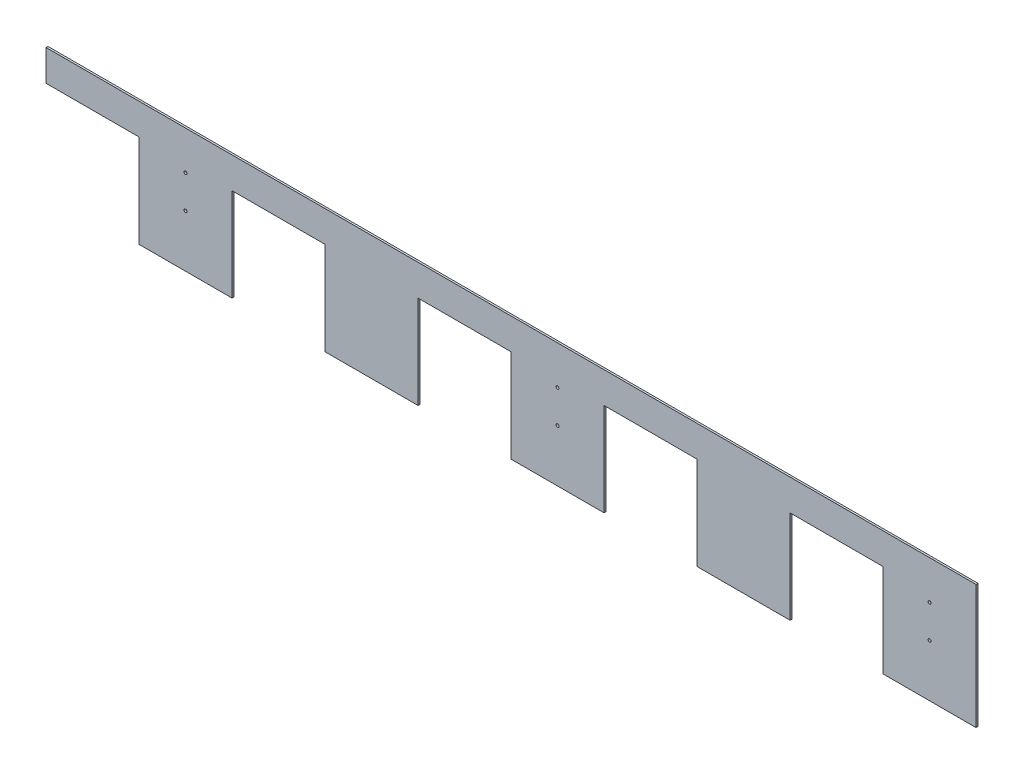
ISO-10303-21;
HEADER;
FILE_DESCRIPTION(('STEP AP214'),'2;1');
FILE_NAME('part.step','',(''),(''),'','','');
FILE_SCHEMA(('AUTOMOTIVE_DESIGN { 1 0 10303 214 1 1 1 1 }'));
ENDSEC;
DATA;
#1=APPLICATION_CONTEXT('core data for automotive mechanical design processes');
#2=APPLICATION_PROTOCOL_DEFINITION('international standard','automotive_design',2000,#1);
#3=PRODUCT_CONTEXT('',#1,'mechanical');
#4=PRODUCT('Part','Part','',(#3));
#5=PRODUCT_RELATED_PRODUCT_CATEGORY('part','',(#4));
#6=PRODUCT_DEFINITION_FORMATION('','',#4);
#7=PRODUCT_DEFINITION_CONTEXT('part definition',#1,'design');
#8=PRODUCT_DEFINITION('design','',#6,#7);
#9=PRODUCT_DEFINITION_SHAPE('','',#8);
#10=(LENGTH_UNIT() NAMED_UNIT(*) SI_UNIT(.MILLI.,.METRE.));
#11=(NAMED_UNIT(*) PLANE_ANGLE_UNIT() SI_UNIT($,.RADIAN.));
#12=(NAMED_UNIT(*) SI_UNIT($,.STERADIAN.) SOLID_ANGLE_UNIT());
#13=UNCERTAINTY_MEASURE_WITH_UNIT(LENGTH_MEASURE(1.E-05),#10,'distance_accuracy_value','');
#14=(GEOMETRIC_REPRESENTATION_CONTEXT(3) GLOBAL_UNCERTAINTY_ASSIGNED_CONTEXT((#13)) GLOBAL_UNIT_ASSIGNED_CONTEXT((#10,
#11,#12)) REPRESENTATION_CONTEXT('',''));
#15=CARTESIAN_POINT('',(0.,0.,0.));
#16=DIRECTION('',(0.,0.,1.));
#17=DIRECTION('',(1.,0.,0.));
#18=AXIS2_PLACEMENT_3D('',#15,#16,#17);
#19=CARTESIAN_POINT('',(0.,0.,3.175));
#20=DIRECTION('',(0.,0.,1.));
#21=DIRECTION('',(1.,0.,0.));
#22=AXIS2_PLACEMENT_3D('',#19,#20,#21);
#23=PLANE('',#22);
#24=CARTESIAN_POINT('',(-533.4,38.1,3.175));
#25=DIRECTION('',(0.,0.,-1.));
#26=DIRECTION('',(-1.,0.,0.));
#27=AXIS2_PLACEMENT_3D('',#24,#25,#26);
#28=CIRCLE('',#27,2.4384);
#29=CARTESIAN_POINT('',(-535.8384,38.1,3.175));
#30=VERTEX_POINT('',#29);
#31=EDGE_CURVE('E205',#30,#30,#28,.T.);
#32=ORIENTED_EDGE('',*,*,#31,.T.);
#33=EDGE_LOOP('',(#32));
#34=FACE_BOUND('',#33,.T.);
#35=CARTESIAN_POINT('',(-533.4,-15.875,3.175));
#36=DIRECTION('',(0.,0.,-1.));
#37=DIRECTION('',(-1.,0.,0.));
#38=AXIS2_PLACEMENT_3D('',#35,#36,#37);
#39=CIRCLE('',#38,2.4384);
#40=CARTESIAN_POINT('',(-535.8384,-15.875,3.175));
#41=VERTEX_POINT('',#40);
#42=EDGE_CURVE('E208',#41,#41,#39,.T.);
#43=ORIENTED_EDGE('',*,*,#42,.T.);
#44=EDGE_LOOP('',(#43));
#45=FACE_BOUND('',#44,.T.);
#46=CARTESIAN_POINT('',(76.2,38.1,3.175));
#47=DIRECTION('',(0.,0.,-1.));
#48=DIRECTION('',(-1.,0.,0.));
#49=AXIS2_PLACEMENT_3D('',#46,#47,#48);
#50=CIRCLE('',#49,2.4384);
#51=CARTESIAN_POINT('',(73.7616,38.1,3.175));
#52=VERTEX_POINT('',#51);
#53=EDGE_CURVE('E211',#52,#52,#50,.T.);
#54=ORIENTED_EDGE('',*,*,#53,.T.);
#55=EDGE_LOOP('',(#54));
#56=FACE_BOUND('',#55,.T.);
#57=CARTESIAN_POINT('',(76.2,-15.875,3.175));
#58=DIRECTION('',(0.,0.,-1.));
#59=DIRECTION('',(-1.,0.,0.));
#60=AXIS2_PLACEMENT_3D('',#57,#58,#59);
#61=CIRCLE('',#60,2.4384);
#62=CARTESIAN_POINT('',(73.7616,-15.875,3.175));
#63=VERTEX_POINT('',#62);
#64=EDGE_CURVE('E214',#63,#63,#61,.T.);
#65=ORIENTED_EDGE('',*,*,#64,.T.);
#66=EDGE_LOOP('',(#65));
#67=FACE_BOUND('',#66,.T.);
#68=CARTESIAN_POINT('',(685.8,-15.875,3.175));
#69=DIRECTION('',(0.,0.,-1.));
#70=DIRECTION('',(-1.,0.,0.));
#71=AXIS2_PLACEMENT_3D('',#68,#69,#70);
#72=CIRCLE('',#71,2.4384);
#73=CARTESIAN_POINT('',(683.3616,-15.875,3.175));
#74=VERTEX_POINT('',#73);
#75=EDGE_CURVE('E216',#74,#74,#72,.T.);
#76=ORIENTED_EDGE('',*,*,#75,.T.);
#77=EDGE_LOOP('',(#76));
#78=FACE_BOUND('',#77,.T.);
#79=CARTESIAN_POINT('',(685.8,38.1,3.175));
#80=DIRECTION('',(0.,0.,-1.));
#81=DIRECTION('',(-1.,0.,0.));
#82=AXIS2_PLACEMENT_3D('',#79,#80,#81);
#83=CIRCLE('',#82,2.4384);
#84=CARTESIAN_POINT('',(683.3616,38.1,3.175));
#85=VERTEX_POINT('',#84);
#86=EDGE_CURVE('E20',#85,#85,#83,.T.);
#87=ORIENTED_EDGE('',*,*,#86,.T.);
#88=EDGE_LOOP('',(#87));
#89=FACE_BOUND('',#88,.T.);
#90=DIRECTION('',(1.,0.,0.));
#91=VECTOR('',#90,1.);
#92=CARTESIAN_POINT('',(-609.6,50.8,3.175));
#93=LINE('',#92,#91);
#94=CARTESIAN_POINT('',(-762.,50.8,3.175));
#95=VERTEX_POINT('',#94);
#96=CARTESIAN_POINT('',(-609.6,50.8,3.175));
#97=VERTEX_POINT('',#96);
#98=EDGE_CURVE('E177',#95,#97,#93,.T.);
#99=ORIENTED_EDGE('',*,*,#98,.T.);
#100=DIRECTION('',(0.,1.,0.));
#101=VECTOR('',#100,1.);
#102=CARTESIAN_POINT('',(-609.6,-101.6,3.175));
#103=LINE('',#102,#101);
#104=CARTESIAN_POINT('',(-609.6,-101.6,3.175));
#105=VERTEX_POINT('',#104);
#106=EDGE_CURVE('E174',#97,#105,#103,.F.);
#107=ORIENTED_EDGE('',*,*,#106,.T.);
#108=DIRECTION('',(1.,0.,0.));
#109=VECTOR('',#108,1.);
#110=CARTESIAN_POINT('',(-762.,-101.6,3.175));
#111=LINE('',#110,#109);
#112=CARTESIAN_POINT('',(-457.2,-101.6,3.175));
#113=VERTEX_POINT('',#112);
#114=EDGE_CURVE('E164',#113,#105,#111,.F.);
#115=ORIENTED_EDGE('',*,*,#114,.F.);
#116=DIRECTION('',(0.,1.,0.));
#117=VECTOR('',#116,1.);
#118=CARTESIAN_POINT('',(-457.2,50.8,3.175));
#119=LINE('',#118,#117);
#120=CARTESIAN_POINT('',(-457.2,50.8,3.175));
#121=VERTEX_POINT('',#120);
#122=EDGE_CURVE('E186',#113,#121,#119,.T.);
#123=ORIENTED_EDGE('',*,*,#122,.T.);
#124=DIRECTION('',(1.,0.,0.));
#125=VECTOR('',#124,1.);
#126=CARTESIAN_POINT('',(-304.8,50.8,3.175));
#127=LINE('',#126,#125);
#128=CARTESIAN_POINT('',(-304.8,50.8,3.175));
#129=VERTEX_POINT('',#128);
#130=EDGE_CURVE('E312',#121,#129,#127,.T.);
#131=ORIENTED_EDGE('',*,*,#130,.T.);
#132=DIRECTION('',(0.,1.,0.));
#133=VECTOR('',#132,1.);
#134=CARTESIAN_POINT('',(-304.8,-101.6,3.175));
#135=LINE('',#134,#133);
#136=CARTESIAN_POINT('',(-304.8,-101.6,3.175));
#137=VERTEX_POINT('',#136);
#138=EDGE_CURVE('E306',#129,#137,#135,.F.);
#139=ORIENTED_EDGE('',*,*,#138,.T.);
#140=DIRECTION('',(1.,0.,0.));
#141=VECTOR('',#140,1.);
#142=CARTESIAN_POINT('',(-762.,-101.6,3.175));
#143=LINE('',#142,#141);
#144=CARTESIAN_POINT('',(-152.4,-101.6,3.175));
#145=VERTEX_POINT('',#144);
#146=EDGE_CURVE('E304',#145,#137,#143,.F.);
#147=ORIENTED_EDGE('',*,*,#146,.F.);
#148=DIRECTION('',(0.,1.,0.));
#149=VECTOR('',#148,1.);
#150=CARTESIAN_POINT('',(-152.4,50.8,3.175));
#151=LINE('',#150,#149);
#152=CARTESIAN_POINT('',(-152.4,50.8,3.175));
#153=VERTEX_POINT('',#152);
#154=EDGE_CURVE('E297',#145,#153,#151,.T.);
#155=ORIENTED_EDGE('',*,*,#154,.T.);
#156=DIRECTION('',(1.,0.,0.));
#157=VECTOR('',#156,1.);
#158=CARTESIAN_POINT('',(0.,50.8,3.175));
#159=LINE('',#158,#157);
#160=CARTESIAN_POINT('',(0.,50.8,3.175));
#161=VERTEX_POINT('',#160);
#162=EDGE_CURVE('E292',#153,#161,#159,.T.);
#163=ORIENTED_EDGE('',*,*,#162,.T.);
#164=DIRECTION('',(0.,1.,0.));
#165=VECTOR('',#164,1.);
#166=CARTESIAN_POINT('',(0.,-101.6,3.175));
#167=LINE('',#166,#165);
#168=CARTESIAN_POINT('',(0.,-101.6,3.175));
#169=VERTEX_POINT('',#168);
#170=EDGE_CURVE('E286',#161,#169,#167,.F.);
#171=ORIENTED_EDGE('',*,*,#170,.T.);
#172=DIRECTION('',(1.,0.,0.));
#173=VECTOR('',#172,1.);
#174=CARTESIAN_POINT('',(-762.,-101.6,3.175));
#175=LINE('',#174,#173);
#176=CARTESIAN_POINT('',(152.4,-101.6,3.175));
#177=VERTEX_POINT('',#176);
#178=EDGE_CURVE('E284',#177,#169,#175,.F.);
#179=ORIENTED_EDGE('',*,*,#178,.F.);
#180=DIRECTION('',(0.,1.,0.));
#181=VECTOR('',#180,1.);
#182=CARTESIAN_POINT('',(152.4,50.8,3.175));
#183=LINE('',#182,#181);
#184=CARTESIAN_POINT('',(152.4,50.8,3.175));
#185=VERTEX_POINT('',#184);
#186=EDGE_CURVE('E277',#177,#185,#183,.T.);
#187=ORIENTED_EDGE('',*,*,#186,.T.);
#188=DIRECTION('',(1.,0.,0.));
#189=VECTOR('',#188,1.);
#190=CARTESIAN_POINT('',(304.8,50.8,3.175));
#191=LINE('',#190,#189);
#192=CARTESIAN_POINT('',(304.8,50.8,3.175));
#193=VERTEX_POINT('',#192);
#194=EDGE_CURVE('E272',#185,#193,#191,.T.);
#195=ORIENTED_EDGE('',*,*,#194,.T.);
#196=DIRECTION('',(0.,1.,0.));
#197=VECTOR('',#196,1.);
#198=CARTESIAN_POINT('',(304.8,-101.6,3.175));
#199=LINE('',#198,#197);
#200=CARTESIAN_POINT('',(304.8,-101.6,3.175));
#201=VERTEX_POINT('',#200);
#202=EDGE_CURVE('E266',#193,#201,#199,.F.);
#203=ORIENTED_EDGE('',*,*,#202,.T.);
#204=DIRECTION('',(1.,0.,0.));
#205=VECTOR('',#204,1.);
#206=CARTESIAN_POINT('',(-762.,-101.6,3.175));
#207=LINE('',#206,#205);
#208=CARTESIAN_POINT('',(457.2,-101.6,3.175));
#209=VERTEX_POINT('',#208);
#210=EDGE_CURVE('E264',#209,#201,#207,.F.);
#211=ORIENTED_EDGE('',*,*,#210,.F.);
#212=DIRECTION('',(0.,1.,0.));
#213=VECTOR('',#212,1.);
#214=CARTESIAN_POINT('',(457.2,50.8,3.175));
#215=LINE('',#214,#213);
#216=CARTESIAN_POINT('',(457.2,50.8,3.175));
#217=VERTEX_POINT('',#216);
#218=EDGE_CURVE('E257',#209,#217,#215,.T.);
#219=ORIENTED_EDGE('',*,*,#218,.T.);
#220=DIRECTION('',(1.,0.,0.));
#221=VECTOR('',#220,1.);
#222=CARTESIAN_POINT('',(609.6,50.8,3.175));
#223=LINE('',#222,#221);
#224=CARTESIAN_POINT('',(609.6,50.8,3.175));
#225=VERTEX_POINT('',#224);
#226=EDGE_CURVE('E252',#217,#225,#223,.T.);
#227=ORIENTED_EDGE('',*,*,#226,.T.);
#228=DIRECTION('',(0.,1.,0.));
#229=VECTOR('',#228,1.);
#230=CARTESIAN_POINT('',(609.6,-101.6,3.175));
#231=LINE('',#230,#229);
#232=CARTESIAN_POINT('',(609.6,-101.6,3.175));
#233=VERTEX_POINT('',#232);
#234=EDGE_CURVE('E246',#225,#233,#231,.F.);
#235=ORIENTED_EDGE('',*,*,#234,.T.);
#236=DIRECTION('',(1.,0.,0.));
#237=VECTOR('',#236,1.);
#238=CARTESIAN_POINT('',(-762.,-101.6,3.175));
#239=LINE('',#238,#237);
#240=CARTESIAN_POINT('',(762.,-101.6,3.175));
#241=VERTEX_POINT('',#240);
#242=EDGE_CURVE('E244',#241,#233,#239,.F.);
#243=ORIENTED_EDGE('',*,*,#242,.F.);
#244=DIRECTION('',(0.,1.,0.));
#245=VECTOR('',#244,1.);
#246=CARTESIAN_POINT('',(762.,-101.6,3.175));
#247=LINE('',#246,#245);
#248=CARTESIAN_POINT('',(762.,101.6,3.175));
#249=VERTEX_POINT('',#248);
#250=EDGE_CURVE('E240',#249,#241,#247,.F.);
#251=ORIENTED_EDGE('',*,*,#250,.F.);
#252=DIRECTION('',(1.,0.,0.));
#253=VECTOR('',#252,1.);
#254=CARTESIAN_POINT('',(762.,101.6,3.175));
#255=LINE('',#254,#253);
#256=CARTESIAN_POINT('',(-762.,101.6,3.175));
#257=VERTEX_POINT('',#256);
#258=EDGE_CURVE('E236',#257,#249,#255,.T.);
#259=ORIENTED_EDGE('',*,*,#258,.F.);
#260=DIRECTION('',(0.,1.,0.));
#261=VECTOR('',#260,1.);
#262=CARTESIAN_POINT('',(-762.,101.6,3.175));
#263=LINE('',#262,#261);
#264=EDGE_CURVE('E232',#95,#257,#263,.T.);
#265=ORIENTED_EDGE('',*,*,#264,.F.);
#266=EDGE_LOOP('',(#99,#107,#115,#123,#131,#139,#147,#155,#163,#171,#179,#187,#195,#203,#211,
#219,#227,#235,#243,#251,#259,#265));
#267=FACE_BOUND('',#266,.T.);
#268=ADVANCED_FACE('F17',(#34,#45,#56,#67,#78,#89,#267),#23,.T.);
#269=CARTESIAN_POINT('',(-609.6,-101.6,3.175));
#270=DIRECTION('',(1.,0.,0.));
#271=DIRECTION('',(0.,0.,-1.));
#272=AXIS2_PLACEMENT_3D('',#269,#270,#271);
#273=PLANE('',#272);
#274=ORIENTED_EDGE('',*,*,#106,.F.);
#275=DIRECTION('',(0.,0.,1.));
#276=VECTOR('',#275,1.);
#277=CARTESIAN_POINT('',(-609.6,50.8,3.175));
#278=LINE('',#277,#276);
#279=CARTESIAN_POINT('',(-609.6,50.8,0.));
#280=VERTEX_POINT('',#279);
#281=EDGE_CURVE('E221',#97,#280,#278,.F.);
#282=ORIENTED_EDGE('',*,*,#281,.T.);
#283=DIRECTION('',(0.,1.,0.));
#284=VECTOR('',#283,1.);
#285=CARTESIAN_POINT('',(-609.6,0.,0.));
#286=LINE('',#285,#284);
#287=CARTESIAN_POINT('',(-609.6,-101.6,0.));
#288=VERTEX_POINT('',#287);
#289=EDGE_CURVE('E184',#280,#288,#286,.F.);
#290=ORIENTED_EDGE('',*,*,#289,.T.);
#291=DIRECTION('',(0.,0.,-1.));
#292=VECTOR('',#291,1.);
#293=CARTESIAN_POINT('',(-609.6,-101.6,0.));
#294=LINE('',#293,#292);
#295=EDGE_CURVE('E171',#105,#288,#294,.T.);
#296=ORIENTED_EDGE('',*,*,#295,.F.);
#297=EDGE_LOOP('',(#274,#282,#290,#296));
#298=FACE_BOUND('',#297,.T.);
#299=ADVANCED_FACE('F183',(#298),#273,.F.);
#300=CARTESIAN_POINT('',(-762.,-101.6,0.));
#301=DIRECTION('',(0.,-1.,0.));
#302=DIRECTION('',(0.,0.,-1.));
#303=AXIS2_PLACEMENT_3D('',#300,#301,#302);
#304=PLANE('',#303);
#305=ORIENTED_EDGE('',*,*,#114,.T.);
#306=ORIENTED_EDGE('',*,*,#295,.T.);
#307=DIRECTION('',(1.,0.,0.));
#308=VECTOR('',#307,1.);
#309=CARTESIAN_POINT('',(0.,-101.6,0.));
#310=LINE('',#309,#308);
#311=CARTESIAN_POINT('',(-457.2,-101.6,0.));
#312=VERTEX_POINT('',#311);
#313=EDGE_CURVE('E329',#288,#312,#310,.T.);
#314=ORIENTED_EDGE('',*,*,#313,.T.);
#315=DIRECTION('',(0.,0.,1.));
#316=VECTOR('',#315,1.);
#317=CARTESIAN_POINT('',(-457.2,-101.6,3.175));
#318=LINE('',#317,#316);
#319=EDGE_CURVE('E173',#312,#113,#318,.T.);
#320=ORIENTED_EDGE('',*,*,#319,.T.);
#321=EDGE_LOOP('',(#305,#306,#314,#320));
#322=FACE_BOUND('',#321,.T.);
#323=ADVANCED_FACE('F168',(#322),#304,.T.);
#324=CARTESIAN_POINT('',(-457.2,50.8,3.175));
#325=DIRECTION('',(-1.,0.,0.));
#326=DIRECTION('',(0.,0.,1.));
#327=AXIS2_PLACEMENT_3D('',#324,#325,#326);
#328=PLANE('',#327);
#329=ORIENTED_EDGE('',*,*,#122,.F.);
#330=ORIENTED_EDGE('',*,*,#319,.F.);
#331=DIRECTION('',(0.,1.,0.));
#332=VECTOR('',#331,1.);
#333=CARTESIAN_POINT('',(-457.2,0.,0.));
#334=LINE('',#333,#332);
#335=CARTESIAN_POINT('',(-457.2,50.8,0.));
#336=VERTEX_POINT('',#335);
#337=EDGE_CURVE('E326',#312,#336,#334,.T.);
#338=ORIENTED_EDGE('',*,*,#337,.T.);
#339=DIRECTION('',(0.,0.,1.));
#340=VECTOR('',#339,1.);
#341=CARTESIAN_POINT('',(-457.2,50.8,3.175));
#342=LINE('',#341,#340);
#343=EDGE_CURVE('E314',#336,#121,#342,.T.);
#344=ORIENTED_EDGE('',*,*,#343,.T.);
#345=EDGE_LOOP('',(#329,#330,#338,#344));
#346=FACE_BOUND('',#345,.T.);
#347=ADVANCED_FACE('F324',(#346),#328,.F.);
#348=CARTESIAN_POINT('',(-304.8,50.8,3.175));
#349=DIRECTION('',(0.,1.,0.));
#350=DIRECTION('',(0.,0.,1.));
#351=AXIS2_PLACEMENT_3D('',#348,#349,#350);
#352=PLANE('',#351);
#353=ORIENTED_EDGE('',*,*,#130,.F.);
#354=ORIENTED_EDGE('',*,*,#343,.F.);
#355=DIRECTION('',(1.,0.,0.));
#356=VECTOR('',#355,1.);
#357=CARTESIAN_POINT('',(0.,50.8,0.));
#358=LINE('',#357,#356);
#359=CARTESIAN_POINT('',(-304.8,50.8,0.));
#360=VERTEX_POINT('',#359);
#361=EDGE_CURVE('E328',#336,#360,#358,.T.);
#362=ORIENTED_EDGE('',*,*,#361,.T.);
#363=DIRECTION('',(0.,0.,-1.));
#364=VECTOR('',#363,1.);
#365=CARTESIAN_POINT('',(-304.8,50.8,3.175));
#366=LINE('',#365,#364);
#367=EDGE_CURVE('E309',#360,#129,#366,.F.);
#368=ORIENTED_EDGE('',*,*,#367,.T.);
#369=EDGE_LOOP('',(#353,#354,#362,#368));
#370=FACE_BOUND('',#369,.T.);
#371=ADVANCED_FACE('F320',(#370),#352,.F.);
#372=CARTESIAN_POINT('',(-304.8,-101.6,3.175));
#373=DIRECTION('',(1.,0.,0.));
#374=DIRECTION('',(0.,0.,-1.));
#375=AXIS2_PLACEMENT_3D('',#372,#373,#374);
#376=PLANE('',#375);
#377=ORIENTED_EDGE('',*,*,#138,.F.);
#378=ORIENTED_EDGE('',*,*,#367,.F.);
#379=DIRECTION('',(0.,1.,0.));
#380=VECTOR('',#379,1.);
#381=CARTESIAN_POINT('',(-304.8,0.,0.));
#382=LINE('',#381,#380);
#383=CARTESIAN_POINT('',(-304.8,-101.6,0.));
#384=VERTEX_POINT('',#383);
#385=EDGE_CURVE('E331',#360,#384,#382,.F.);
#386=ORIENTED_EDGE('',*,*,#385,.T.);
#387=DIRECTION('',(0.,0.,-1.));
#388=VECTOR('',#387,1.);
#389=CARTESIAN_POINT('',(-304.8,-101.6,0.));
#390=LINE('',#389,#388);
#391=EDGE_CURVE('E302',#137,#384,#390,.T.);
#392=ORIENTED_EDGE('',*,*,#391,.F.);
#393=EDGE_LOOP('',(#377,#378,#386,#392));
#394=FACE_BOUND('',#393,.T.);
#395=ADVANCED_FACE('F455',(#394),#376,.F.);
#396=CARTESIAN_POINT('',(-762.,-101.6,0.));
#397=DIRECTION('',(0.,-1.,0.));
#398=DIRECTION('',(0.,0.,-1.));
#399=AXIS2_PLACEMENT_3D('',#396,#397,#398);
#400=PLANE('',#399);
#401=ORIENTED_EDGE('',*,*,#146,.T.);
#402=ORIENTED_EDGE('',*,*,#391,.T.);
#403=DIRECTION('',(1.,0.,0.));
#404=VECTOR('',#403,1.);
#405=CARTESIAN_POINT('',(0.,-101.6,0.));
#406=LINE('',#405,#404);
#407=CARTESIAN_POINT('',(-152.4,-101.6,0.));
#408=VERTEX_POINT('',#407);
#409=EDGE_CURVE('E336',#384,#408,#406,.T.);
#410=ORIENTED_EDGE('',*,*,#409,.T.);
#411=DIRECTION('',(0.,0.,1.));
#412=VECTOR('',#411,1.);
#413=CARTESIAN_POINT('',(-152.4,-101.6,3.175));
#414=LINE('',#413,#412);
#415=EDGE_CURVE('E299',#408,#145,#414,.T.);
#416=ORIENTED_EDGE('',*,*,#415,.T.);
#417=EDGE_LOOP('',(#401,#402,#410,#416));
#418=FACE_BOUND('',#417,.T.);
#419=ADVANCED_FACE('F451',(#418),#400,.T.);
#420=CARTESIAN_POINT('',(-152.4,50.8,3.175));
#421=DIRECTION('',(-1.,0.,0.));
#422=DIRECTION('',(0.,0.,1.));
#423=AXIS2_PLACEMENT_3D('',#420,#421,#422);
#424=PLANE('',#423);
#425=ORIENTED_EDGE('',*,*,#154,.F.);
#426=ORIENTED_EDGE('',*,*,#415,.F.);
#427=DIRECTION('',(0.,1.,0.));
#428=VECTOR('',#427,1.);
#429=CARTESIAN_POINT('',(-152.4,0.,0.));
#430=LINE('',#429,#428);
#431=CARTESIAN_POINT('',(-152.4,50.8,0.));
#432=VERTEX_POINT('',#431);
#433=EDGE_CURVE('E339',#408,#432,#430,.T.);
#434=ORIENTED_EDGE('',*,*,#433,.T.);
#435=DIRECTION('',(0.,0.,1.));
#436=VECTOR('',#435,1.);
#437=CARTESIAN_POINT('',(-152.4,50.8,3.175));
#438=LINE('',#437,#436);
#439=EDGE_CURVE('E294',#432,#153,#438,.T.);
#440=ORIENTED_EDGE('',*,*,#439,.T.);
#441=EDGE_LOOP('',(#425,#426,#434,#440));
#442=FACE_BOUND('',#441,.T.);
#443=ADVANCED_FACE('F449',(#442),#424,.F.);
#444=CARTESIAN_POINT('',(0.,50.8,3.175));
#445=DIRECTION('',(0.,1.,0.));
#446=DIRECTION('',(0.,0.,1.));
#447=AXIS2_PLACEMENT_3D('',#444,#445,#446);
#448=PLANE('',#447);
#449=ORIENTED_EDGE('',*,*,#162,.F.);
#450=ORIENTED_EDGE('',*,*,#439,.F.);
#451=DIRECTION('',(1.,0.,0.));
#452=VECTOR('',#451,1.);
#453=CARTESIAN_POINT('',(0.,50.8,0.));
#454=LINE('',#453,#452);
#455=CARTESIAN_POINT('',(0.,50.8,0.));
#456=VERTEX_POINT('',#455);
#457=EDGE_CURVE('E342',#432,#456,#454,.T.);
#458=ORIENTED_EDGE('',*,*,#457,.T.);
#459=DIRECTION('',(0.,0.,-1.));
#460=VECTOR('',#459,1.);
#461=CARTESIAN_POINT('',(0.,50.8,3.175));
#462=LINE('',#461,#460);
#463=EDGE_CURVE('E289',#456,#161,#462,.F.);
#464=ORIENTED_EDGE('',*,*,#463,.T.);
#465=EDGE_LOOP('',(#449,#450,#458,#464));
#466=FACE_BOUND('',#465,.T.);
#467=ADVANCED_FACE('F444',(#466),#448,.F.);
#468=CARTESIAN_POINT('',(0.,-101.6,3.175));
#469=DIRECTION('',(1.,0.,0.));
#470=DIRECTION('',(0.,0.,-1.));
#471=AXIS2_PLACEMENT_3D('',#468,#469,#470);
#472=PLANE('',#471);
#473=ORIENTED_EDGE('',*,*,#170,.F.);
#474=ORIENTED_EDGE('',*,*,#463,.F.);
#475=DIRECTION('',(0.,1.,0.));
#476=VECTOR('',#475,1.);
#477=CARTESIAN_POINT('',(0.,0.,0.));
#478=LINE('',#477,#476);
#479=CARTESIAN_POINT('',(0.,-101.6,0.));
#480=VERTEX_POINT('',#479);
#481=EDGE_CURVE('E345',#456,#480,#478,.F.);
#482=ORIENTED_EDGE('',*,*,#481,.T.);
#483=DIRECTION('',(0.,0.,-1.));
#484=VECTOR('',#483,1.);
#485=CARTESIAN_POINT('',(0.,-101.6,0.));
#486=LINE('',#485,#484);
#487=EDGE_CURVE('E282',#169,#480,#486,.T.);
#488=ORIENTED_EDGE('',*,*,#487,.F.);
#489=EDGE_LOOP('',(#473,#474,#482,#488));
#490=FACE_BOUND('',#489,.T.);
#491=ADVANCED_FACE('F441',(#490),#472,.F.);
#492=CARTESIAN_POINT('',(-762.,-101.6,0.));
#493=DIRECTION('',(0.,-1.,0.));
#494=DIRECTION('',(0.,0.,-1.));
#495=AXIS2_PLACEMENT_3D('',#492,#493,#494);
#496=PLANE('',#495);
#497=ORIENTED_EDGE('',*,*,#178,.T.);
#498=ORIENTED_EDGE('',*,*,#487,.T.);
#499=DIRECTION('',(1.,0.,0.));
#500=VECTOR('',#499,1.);
#501=CARTESIAN_POINT('',(0.,-101.6,0.));
#502=LINE('',#501,#500);
#503=CARTESIAN_POINT('',(152.4,-101.6,0.));
#504=VERTEX_POINT('',#503);
#505=EDGE_CURVE('E348',#480,#504,#502,.T.);
#506=ORIENTED_EDGE('',*,*,#505,.T.);
#507=DIRECTION('',(0.,0.,1.));
#508=VECTOR('',#507,1.);
#509=CARTESIAN_POINT('',(152.4,-101.6,3.175));
#510=LINE('',#509,#508);
#511=EDGE_CURVE('E279',#504,#177,#510,.T.);
#512=ORIENTED_EDGE('',*,*,#511,.T.);
#513=EDGE_LOOP('',(#497,#498,#506,#512));
#514=FACE_BOUND('',#513,.T.);
#515=ADVANCED_FACE('F435',(#514),#496,.T.);
#516=CARTESIAN_POINT('',(152.4,50.8,3.175));
#517=DIRECTION('',(-1.,0.,0.));
#518=DIRECTION('',(0.,0.,1.));
#519=AXIS2_PLACEMENT_3D('',#516,#517,#518);
#520=PLANE('',#519);
#521=ORIENTED_EDGE('',*,*,#186,.F.);
#522=ORIENTED_EDGE('',*,*,#511,.F.);
#523=DIRECTION('',(0.,1.,0.));
#524=VECTOR('',#523,1.);
#525=CARTESIAN_POINT('',(152.4,0.,0.));
#526=LINE('',#525,#524);
#527=CARTESIAN_POINT('',(152.4,50.8,0.));
#528=VERTEX_POINT('',#527);
#529=EDGE_CURVE('E351',#504,#528,#526,.T.);
#530=ORIENTED_EDGE('',*,*,#529,.T.);
#531=DIRECTION('',(0.,0.,1.));
#532=VECTOR('',#531,1.);
#533=CARTESIAN_POINT('',(152.4,50.8,3.175));
#534=LINE('',#533,#532);
#535=EDGE_CURVE('E274',#528,#185,#534,.T.);
#536=ORIENTED_EDGE('',*,*,#535,.T.);
#537=EDGE_LOOP('',(#521,#522,#530,#536));
#538=FACE_BOUND('',#537,.T.);
#539=ADVANCED_FACE('F433',(#538),#520,.F.);
#540=CARTESIAN_POINT('',(304.8,50.8,3.175));
#541=DIRECTION('',(0.,1.,0.));
#542=DIRECTION('',(0.,0.,1.));
#543=AXIS2_PLACEMENT_3D('',#540,#541,#542);
#544=PLANE('',#543);
#545=ORIENTED_EDGE('',*,*,#194,.F.);
#546=ORIENTED_EDGE('',*,*,#535,.F.);
#547=DIRECTION('',(1.,0.,0.));
#548=VECTOR('',#547,1.);
#549=CARTESIAN_POINT('',(0.,50.8,0.));
#550=LINE('',#549,#548);
#551=CARTESIAN_POINT('',(304.8,50.8,0.));
#552=VERTEX_POINT('',#551);
#553=EDGE_CURVE('E354',#528,#552,#550,.T.);
#554=ORIENTED_EDGE('',*,*,#553,.T.);
#555=DIRECTION('',(0.,0.,-1.));
#556=VECTOR('',#555,1.);
#557=CARTESIAN_POINT('',(304.8,50.8,3.175));
#558=LINE('',#557,#556);
#559=EDGE_CURVE('E269',#552,#193,#558,.F.);
#560=ORIENTED_EDGE('',*,*,#559,.T.);
#561=EDGE_LOOP('',(#545,#546,#554,#560));
#562=FACE_BOUND('',#561,.T.);
#563=ADVANCED_FACE('F428',(#562),#544,.F.);
#564=CARTESIAN_POINT('',(304.8,-101.6,3.175));
#565=DIRECTION('',(1.,0.,0.));
#566=DIRECTION('',(0.,0.,-1.));
#567=AXIS2_PLACEMENT_3D('',#564,#565,#566);
#568=PLANE('',#567);
#569=ORIENTED_EDGE('',*,*,#202,.F.);
#570=ORIENTED_EDGE('',*,*,#559,.F.);
#571=DIRECTION('',(0.,1.,0.));
#572=VECTOR('',#571,1.);
#573=CARTESIAN_POINT('',(304.8,0.,0.));
#574=LINE('',#573,#572);
#575=CARTESIAN_POINT('',(304.8,-101.6,0.));
#576=VERTEX_POINT('',#575);
#577=EDGE_CURVE('E357',#552,#576,#574,.F.);
#578=ORIENTED_EDGE('',*,*,#577,.T.);
#579=DIRECTION('',(0.,0.,-1.));
#580=VECTOR('',#579,1.);
#581=CARTESIAN_POINT('',(304.8,-101.6,0.));
#582=LINE('',#581,#580);
#583=EDGE_CURVE('E262',#201,#576,#582,.T.);
#584=ORIENTED_EDGE('',*,*,#583,.F.);
#585=EDGE_LOOP('',(#569,#570,#578,#584));
#586=FACE_BOUND('',#585,.T.);
#587=ADVANCED_FACE('F425',(#586),#568,.F.);
#588=CARTESIAN_POINT('',(-762.,-101.6,0.));
#589=DIRECTION('',(0.,-1.,0.));
#590=DIRECTION('',(0.,0.,-1.));
#591=AXIS2_PLACEMENT_3D('',#588,#589,#590);
#592=PLANE('',#591);
#593=ORIENTED_EDGE('',*,*,#210,.T.);
#594=ORIENTED_EDGE('',*,*,#583,.T.);
#595=DIRECTION('',(1.,0.,0.));
#596=VECTOR('',#595,1.);
#597=CARTESIAN_POINT('',(0.,-101.6,0.));
#598=LINE('',#597,#596);
#599=CARTESIAN_POINT('',(457.2,-101.6,0.));
#600=VERTEX_POINT('',#599);
#601=EDGE_CURVE('E360',#576,#600,#598,.T.);
#602=ORIENTED_EDGE('',*,*,#601,.T.);
#603=DIRECTION('',(0.,0.,1.));
#604=VECTOR('',#603,1.);
#605=CARTESIAN_POINT('',(457.2,-101.6,3.175));
#606=LINE('',#605,#604);
#607=EDGE_CURVE('E259',#600,#209,#606,.T.);
#608=ORIENTED_EDGE('',*,*,#607,.T.);
#609=EDGE_LOOP('',(#593,#594,#602,#608));
#610=FACE_BOUND('',#609,.T.);
#611=ADVANCED_FACE('F419',(#610),#592,.T.);
#612=CARTESIAN_POINT('',(457.2,50.8,3.175));
#613=DIRECTION('',(-1.,0.,0.));
#614=DIRECTION('',(0.,0.,1.));
#615=AXIS2_PLACEMENT_3D('',#612,#613,#614);
#616=PLANE('',#615);
#617=ORIENTED_EDGE('',*,*,#218,.F.);
#618=ORIENTED_EDGE('',*,*,#607,.F.);
#619=DIRECTION('',(0.,1.,0.));
#620=VECTOR('',#619,1.);
#621=CARTESIAN_POINT('',(457.2,0.,0.));
#622=LINE('',#621,#620);
#623=CARTESIAN_POINT('',(457.2,50.8,0.));
#624=VERTEX_POINT('',#623);
#625=EDGE_CURVE('E363',#600,#624,#622,.T.);
#626=ORIENTED_EDGE('',*,*,#625,.T.);
#627=DIRECTION('',(0.,0.,1.));
#628=VECTOR('',#627,1.);
#629=CARTESIAN_POINT('',(457.2,50.8,3.175));
#630=LINE('',#629,#628);
#631=EDGE_CURVE('E254',#624,#217,#630,.T.);
#632=ORIENTED_EDGE('',*,*,#631,.T.);
#633=EDGE_LOOP('',(#617,#618,#626,#632));
#634=FACE_BOUND('',#633,.T.);
#635=ADVANCED_FACE('F417',(#634),#616,.F.);
#636=CARTESIAN_POINT('',(609.6,50.8,3.175));
#637=DIRECTION('',(0.,1.,0.));
#638=DIRECTION('',(0.,0.,1.));
#639=AXIS2_PLACEMENT_3D('',#636,#637,#638);
#640=PLANE('',#639);
#641=ORIENTED_EDGE('',*,*,#226,.F.);
#642=ORIENTED_EDGE('',*,*,#631,.F.);
#643=DIRECTION('',(1.,0.,0.));
#644=VECTOR('',#643,1.);
#645=CARTESIAN_POINT('',(0.,50.8,0.));
#646=LINE('',#645,#644);
#647=CARTESIAN_POINT('',(609.6,50.8,0.));
#648=VERTEX_POINT('',#647);
#649=EDGE_CURVE('E366',#624,#648,#646,.T.);
#650=ORIENTED_EDGE('',*,*,#649,.T.);
#651=DIRECTION('',(0.,0.,-1.));
#652=VECTOR('',#651,1.);
#653=CARTESIAN_POINT('',(609.6,50.8,3.175));
#654=LINE('',#653,#652);
#655=EDGE_CURVE('E249',#648,#225,#654,.F.);
#656=ORIENTED_EDGE('',*,*,#655,.T.);
#657=EDGE_LOOP('',(#641,#642,#650,#656));
#658=FACE_BOUND('',#657,.T.);
#659=ADVANCED_FACE('F412',(#658),#640,.F.);
#660=CARTESIAN_POINT('',(609.6,-101.6,3.175));
#661=DIRECTION('',(1.,0.,0.));
#662=DIRECTION('',(0.,0.,-1.));
#663=AXIS2_PLACEMENT_3D('',#660,#661,#662);
#664=PLANE('',#663);
#665=ORIENTED_EDGE('',*,*,#234,.F.);
#666=ORIENTED_EDGE('',*,*,#655,.F.);
#667=DIRECTION('',(0.,1.,0.));
#668=VECTOR('',#667,1.);
#669=CARTESIAN_POINT('',(609.6,0.,0.));
#670=LINE('',#669,#668);
#671=CARTESIAN_POINT('',(609.6,-101.6,0.));
#672=VERTEX_POINT('',#671);
#673=EDGE_CURVE('E369',#648,#672,#670,.F.);
#674=ORIENTED_EDGE('',*,*,#673,.T.);
#675=DIRECTION('',(0.,0.,-1.));
#676=VECTOR('',#675,1.);
#677=CARTESIAN_POINT('',(609.6,-101.6,0.));
#678=LINE('',#677,#676);
#679=EDGE_CURVE('E242',#233,#672,#678,.T.);
#680=ORIENTED_EDGE('',*,*,#679,.F.);
#681=EDGE_LOOP('',(#665,#666,#674,#680));
#682=FACE_BOUND('',#681,.T.);
#683=ADVANCED_FACE('F409',(#682),#664,.F.);
#684=CARTESIAN_POINT('',(-762.,-101.6,0.));
#685=DIRECTION('',(0.,-1.,0.));
#686=DIRECTION('',(0.,0.,-1.));
#687=AXIS2_PLACEMENT_3D('',#684,#685,#686);
#688=PLANE('',#687);
#689=ORIENTED_EDGE('',*,*,#242,.T.);
#690=ORIENTED_EDGE('',*,*,#679,.T.);
#691=DIRECTION('',(1.,0.,0.));
#692=VECTOR('',#691,1.);
#693=CARTESIAN_POINT('',(0.,-101.6,0.));
#694=LINE('',#693,#692);
#695=CARTESIAN_POINT('',(762.,-101.6,0.));
#696=VERTEX_POINT('',#695);
#697=EDGE_CURVE('E372',#672,#696,#694,.T.);
#698=ORIENTED_EDGE('',*,*,#697,.T.);
#699=DIRECTION('',(0.,0.,-1.));
#700=VECTOR('',#699,1.);
#701=CARTESIAN_POINT('',(762.,-101.6,0.));
#702=LINE('',#701,#700);
#703=EDGE_CURVE('E238',#241,#696,#702,.T.);
#704=ORIENTED_EDGE('',*,*,#703,.F.);
#705=EDGE_LOOP('',(#689,#690,#698,#704));
#706=FACE_BOUND('',#705,.T.);
#707=ADVANCED_FACE('F403',(#706),#688,.T.);
#708=CARTESIAN_POINT('',(762.,-101.6,0.));
#709=DIRECTION('',(1.,0.,0.));
#710=DIRECTION('',(0.,0.,-1.));
#711=AXIS2_PLACEMENT_3D('',#708,#709,#710);
#712=PLANE('',#711);
#713=ORIENTED_EDGE('',*,*,#703,.T.);
#714=DIRECTION('',(0.,1.,0.));
#715=VECTOR('',#714,1.);
#716=CARTESIAN_POINT('',(762.,0.,0.));
#717=LINE('',#716,#715);
#718=CARTESIAN_POINT('',(762.,101.6,0.));
#719=VERTEX_POINT('',#718);
#720=EDGE_CURVE('E375',#696,#719,#717,.T.);
#721=ORIENTED_EDGE('',*,*,#720,.T.);
#722=DIRECTION('',(0.,0.,1.));
#723=VECTOR('',#722,1.);
#724=CARTESIAN_POINT('',(762.,101.6,0.));
#725=LINE('',#724,#723);
#726=EDGE_CURVE('E234',#249,#719,#725,.F.);
#727=ORIENTED_EDGE('',*,*,#726,.F.);
#728=ORIENTED_EDGE('',*,*,#250,.T.);
#729=EDGE_LOOP('',(#713,#721,#727,#728));
#730=FACE_BOUND('',#729,.T.);
#731=ADVANCED_FACE('F399',(#730),#712,.T.);
#732=CARTESIAN_POINT('',(762.,101.6,0.));
#733=DIRECTION('',(0.,1.,0.));
#734=DIRECTION('',(0.,0.,1.));
#735=AXIS2_PLACEMENT_3D('',#732,#733,#734);
#736=PLANE('',#735);
#737=ORIENTED_EDGE('',*,*,#726,.T.);
#738=DIRECTION('',(1.,0.,0.));
#739=VECTOR('',#738,1.);
#740=CARTESIAN_POINT('',(0.,101.6,0.));
#741=LINE('',#740,#739);
#742=CARTESIAN_POINT('',(-762.,101.6,0.));
#743=VERTEX_POINT('',#742);
#744=EDGE_CURVE('E378',#719,#743,#741,.F.);
#745=ORIENTED_EDGE('',*,*,#744,.T.);
#746=DIRECTION('',(0.,0.,1.));
#747=VECTOR('',#746,1.);
#748=CARTESIAN_POINT('',(-762.,101.6,0.));
#749=LINE('',#748,#747);
#750=EDGE_CURVE('E230',#257,#743,#749,.F.);
#751=ORIENTED_EDGE('',*,*,#750,.F.);
#752=ORIENTED_EDGE('',*,*,#258,.T.);
#753=EDGE_LOOP('',(#737,#745,#751,#752));
#754=FACE_BOUND('',#753,.T.);
#755=ADVANCED_FACE('F393',(#754),#736,.T.);
#756=CARTESIAN_POINT('',(-762.,101.6,0.));
#757=DIRECTION('',(-1.,0.,0.));
#758=DIRECTION('',(0.,0.,1.));
#759=AXIS2_PLACEMENT_3D('',#756,#757,#758);
#760=PLANE('',#759);
#761=DIRECTION('',(0.,1.,0.));
#762=VECTOR('',#761,1.);
#763=CARTESIAN_POINT('',(-762.,0.,0.));
#764=LINE('',#763,#762);
#765=CARTESIAN_POINT('',(-762.,50.8,0.));
#766=VERTEX_POINT('',#765);
#767=EDGE_CURVE('E381',#743,#766,#764,.F.);
#768=ORIENTED_EDGE('',*,*,#767,.T.);
#769=DIRECTION('',(0.,0.,1.));
#770=VECTOR('',#769,1.);
#771=CARTESIAN_POINT('',(-762.,50.8,3.175));
#772=LINE('',#771,#770);
#773=EDGE_CURVE('E35',#766,#95,#772,.T.);
#774=ORIENTED_EDGE('',*,*,#773,.T.);
#775=ORIENTED_EDGE('',*,*,#264,.T.);
#776=ORIENTED_EDGE('',*,*,#750,.T.);
#777=EDGE_LOOP('',(#768,#774,#775,#776));
#778=FACE_BOUND('',#777,.T.);
#779=ADVANCED_FACE('F389',(#778),#760,.T.);
#780=CARTESIAN_POINT('',(-609.6,50.8,3.175));
#781=DIRECTION('',(0.,1.,0.));
#782=DIRECTION('',(0.,0.,1.));
#783=AXIS2_PLACEMENT_3D('',#780,#781,#782);
#784=PLANE('',#783);
#785=ORIENTED_EDGE('',*,*,#98,.F.);
#786=ORIENTED_EDGE('',*,*,#773,.F.);
#787=DIRECTION('',(1.,0.,0.));
#788=VECTOR('',#787,1.);
#789=CARTESIAN_POINT('',(0.,50.8,0.));
#790=LINE('',#789,#788);
#791=EDGE_CURVE('E204',#766,#280,#790,.T.);
#792=ORIENTED_EDGE('',*,*,#791,.T.);
#793=ORIENTED_EDGE('',*,*,#281,.F.);
#794=EDGE_LOOP('',(#785,#786,#792,#793));
#795=FACE_BOUND('',#794,.T.);
#796=ADVANCED_FACE('F384',(#795),#784,.F.);
#797=CARTESIAN_POINT('',(685.8,38.1,3.175));
#798=DIRECTION('',(0.,0.,-1.));
#799=DIRECTION('',(-1.,0.,0.));
#800=AXIS2_PLACEMENT_3D('',#797,#798,#799);
#801=CYLINDRICAL_SURFACE('',#800,2.4384);
#802=ORIENTED_EDGE('',*,*,#86,.F.);
#803=EDGE_LOOP('',(#802));
#804=FACE_BOUND('',#803,.T.);
#805=CARTESIAN_POINT('',(685.8,38.1,0.));
#806=DIRECTION('',(0.,0.,-1.));
#807=DIRECTION('',(-1.,0.,0.));
#808=AXIS2_PLACEMENT_3D('',#805,#806,#807);
#809=CIRCLE('',#808,2.4384);
#810=CARTESIAN_POINT('',(683.3616,38.1,0.));
#811=VERTEX_POINT('',#810);
#812=EDGE_CURVE('E201',#811,#811,#809,.T.);
#813=ORIENTED_EDGE('',*,*,#812,.T.);
#814=EDGE_LOOP('',(#813));
#815=FACE_BOUND('',#814,.T.);
#816=ADVANCED_FACE('F492',(#804,#815),#801,.F.);
#817=CARTESIAN_POINT('',(685.8,-15.875,3.175));
#818=DIRECTION('',(0.,0.,-1.));
#819=DIRECTION('',(-1.,0.,0.));
#820=AXIS2_PLACEMENT_3D('',#817,#818,#819);
#821=CYLINDRICAL_SURFACE('',#820,2.4384);
#822=ORIENTED_EDGE('',*,*,#75,.F.);
#823=EDGE_LOOP('',(#822));
#824=FACE_BOUND('',#823,.T.);
#825=CARTESIAN_POINT('',(685.8,-15.875,0.));
#826=DIRECTION('',(0.,0.,-1.));
#827=DIRECTION('',(-1.,0.,0.));
#828=AXIS2_PLACEMENT_3D('',#825,#826,#827);
#829=CIRCLE('',#828,2.4384);
#830=CARTESIAN_POINT('',(683.3616,-15.875,0.));
#831=VERTEX_POINT('',#830);
#832=EDGE_CURVE('E198',#831,#831,#829,.T.);
#833=ORIENTED_EDGE('',*,*,#832,.T.);
#834=EDGE_LOOP('',(#833));
#835=FACE_BOUND('',#834,.T.);
#836=ADVANCED_FACE('F488',(#824,#835),#821,.F.);
#837=CARTESIAN_POINT('',(76.2,-15.875,3.175));
#838=DIRECTION('',(0.,0.,-1.));
#839=DIRECTION('',(-1.,0.,0.));
#840=AXIS2_PLACEMENT_3D('',#837,#838,#839);
#841=CYLINDRICAL_SURFACE('',#840,2.4384);
#842=ORIENTED_EDGE('',*,*,#64,.F.);
#843=EDGE_LOOP('',(#842));
#844=FACE_BOUND('',#843,.T.);
#845=CARTESIAN_POINT('',(76.2,-15.875,0.));
#846=DIRECTION('',(0.,0.,-1.));
#847=DIRECTION('',(-1.,0.,0.));
#848=AXIS2_PLACEMENT_3D('',#845,#846,#847);
#849=CIRCLE('',#848,2.4384);
#850=CARTESIAN_POINT('',(73.7616,-15.875,0.));
#851=VERTEX_POINT('',#850);
#852=EDGE_CURVE('E195',#851,#851,#849,.T.);
#853=ORIENTED_EDGE('',*,*,#852,.T.);
#854=EDGE_LOOP('',(#853));
#855=FACE_BOUND('',#854,.T.);
#856=ADVANCED_FACE('F484',(#844,#855),#841,.F.);
#857=CARTESIAN_POINT('',(76.2,38.1,3.175));
#858=DIRECTION('',(0.,0.,-1.));
#859=DIRECTION('',(-1.,0.,0.));
#860=AXIS2_PLACEMENT_3D('',#857,#858,#859);
#861=CYLINDRICAL_SURFACE('',#860,2.4384);
#862=ORIENTED_EDGE('',*,*,#53,.F.);
#863=EDGE_LOOP('',(#862));
#864=FACE_BOUND('',#863,.T.);
#865=CARTESIAN_POINT('',(76.2,38.1,0.));
#866=DIRECTION('',(0.,0.,-1.));
#867=DIRECTION('',(-1.,0.,0.));
#868=AXIS2_PLACEMENT_3D('',#865,#866,#867);
#869=CIRCLE('',#868,2.4384);
#870=CARTESIAN_POINT('',(73.7616,38.1,0.));
#871=VERTEX_POINT('',#870);
#872=EDGE_CURVE('E192',#871,#871,#869,.T.);
#873=ORIENTED_EDGE('',*,*,#872,.T.);
#874=EDGE_LOOP('',(#873));
#875=FACE_BOUND('',#874,.T.);
#876=ADVANCED_FACE('F480',(#864,#875),#861,.F.);
#877=CARTESIAN_POINT('',(-533.4,-15.875,3.175));
#878=DIRECTION('',(0.,0.,-1.));
#879=DIRECTION('',(-1.,0.,0.));
#880=AXIS2_PLACEMENT_3D('',#877,#878,#879);
#881=CYLINDRICAL_SURFACE('',#880,2.4384);
#882=ORIENTED_EDGE('',*,*,#42,.F.);
#883=EDGE_LOOP('',(#882));
#884=FACE_BOUND('',#883,.T.);
#885=CARTESIAN_POINT('',(-533.4,-15.875,0.));
#886=DIRECTION('',(0.,0.,-1.));
#887=DIRECTION('',(-1.,0.,0.));
#888=AXIS2_PLACEMENT_3D('',#885,#886,#887);
#889=CIRCLE('',#888,2.4384);
#890=CARTESIAN_POINT('',(-535.8384,-15.875,0.));
#891=VERTEX_POINT('',#890);
#892=EDGE_CURVE('E26',#891,#891,#889,.T.);
#893=ORIENTED_EDGE('',*,*,#892,.T.);
#894=EDGE_LOOP('',(#893));
#895=FACE_BOUND('',#894,.T.);
#896=ADVANCED_FACE('F472',(#884,#895),#881,.F.);
#897=CARTESIAN_POINT('',(-533.4,38.1,3.175));
#898=DIRECTION('',(0.,0.,-1.));
#899=DIRECTION('',(-1.,0.,0.));
#900=AXIS2_PLACEMENT_3D('',#897,#898,#899);
#901=CYLINDRICAL_SURFACE('',#900,2.4384);
#902=ORIENTED_EDGE('',*,*,#31,.F.);
#903=EDGE_LOOP('',(#902));
#904=FACE_BOUND('',#903,.T.);
#905=CARTESIAN_POINT('',(-533.4,38.1,0.));
#906=DIRECTION('',(0.,0.,-1.));
#907=DIRECTION('',(-1.,0.,0.));
#908=AXIS2_PLACEMENT_3D('',#905,#906,#907);
#909=CIRCLE('',#908,2.4384);
#910=CARTESIAN_POINT('',(-535.8384,38.1,0.));
#911=VERTEX_POINT('',#910);
#912=EDGE_CURVE('E11',#911,#911,#909,.T.);
#913=ORIENTED_EDGE('',*,*,#912,.T.);
#914=EDGE_LOOP('',(#913));
#915=FACE_BOUND('',#914,.T.);
#916=ADVANCED_FACE('F466',(#904,#915),#901,.F.);
#917=CARTESIAN_POINT('',(0.,0.,0.));
#918=DIRECTION('',(0.,0.,1.));
#919=DIRECTION('',(1.,0.,0.));
#920=AXIS2_PLACEMENT_3D('',#917,#918,#919);
#921=PLANE('',#920);
#922=ORIENTED_EDGE('',*,*,#912,.F.);
#923=EDGE_LOOP('',(#922));
#924=FACE_BOUND('',#923,.T.);
#925=ORIENTED_EDGE('',*,*,#892,.F.);
#926=EDGE_LOOP('',(#925));
#927=FACE_BOUND('',#926,.T.);
#928=ORIENTED_EDGE('',*,*,#872,.F.);
#929=EDGE_LOOP('',(#928));
#930=FACE_BOUND('',#929,.T.);
#931=ORIENTED_EDGE('',*,*,#852,.F.);
#932=EDGE_LOOP('',(#931));
#933=FACE_BOUND('',#932,.T.);
#934=ORIENTED_EDGE('',*,*,#832,.F.);
#935=EDGE_LOOP('',(#934));
#936=FACE_BOUND('',#935,.T.);
#937=ORIENTED_EDGE('',*,*,#812,.F.);
#938=EDGE_LOOP('',(#937));
#939=FACE_BOUND('',#938,.T.);
#940=ORIENTED_EDGE('',*,*,#767,.F.);
#941=ORIENTED_EDGE('',*,*,#744,.F.);
#942=ORIENTED_EDGE('',*,*,#720,.F.);
#943=ORIENTED_EDGE('',*,*,#697,.F.);
#944=ORIENTED_EDGE('',*,*,#673,.F.);
#945=ORIENTED_EDGE('',*,*,#649,.F.);
#946=ORIENTED_EDGE('',*,*,#625,.F.);
#947=ORIENTED_EDGE('',*,*,#601,.F.);
#948=ORIENTED_EDGE('',*,*,#577,.F.);
#949=ORIENTED_EDGE('',*,*,#553,.F.);
#950=ORIENTED_EDGE('',*,*,#529,.F.);
#951=ORIENTED_EDGE('',*,*,#505,.F.);
#952=ORIENTED_EDGE('',*,*,#481,.F.);
#953=ORIENTED_EDGE('',*,*,#457,.F.);
#954=ORIENTED_EDGE('',*,*,#433,.F.);
#955=ORIENTED_EDGE('',*,*,#409,.F.);
#956=ORIENTED_EDGE('',*,*,#385,.F.);
#957=ORIENTED_EDGE('',*,*,#361,.F.);
#958=ORIENTED_EDGE('',*,*,#337,.F.);
#959=ORIENTED_EDGE('',*,*,#313,.F.);
#960=ORIENTED_EDGE('',*,*,#289,.F.);
#961=ORIENTED_EDGE('',*,*,#791,.F.);
#962=EDGE_LOOP('',(#940,#941,#942,#943,#944,#945,#946,#947,#948,#949,#950,#951,#952,#953,#954,
#955,#956,#957,#958,#959,#960,#961));
#963=FACE_BOUND('',#962,.T.);
#964=ADVANCED_FACE('F386',(#924,#927,#930,#933,#936,#939,#963),#921,.F.);
#965=CLOSED_SHELL('',(#268,#299,#323,#347,#371,#395,#419,#443,#467,#491,#515,#539,#563,#587,
#611,#635,#659,#683,#707,#731,#755,#779,#796,#816,#836,#856,#876,#896,#916,#964));
#966=MANIFOLD_SOLID_BREP('B1',#965);
#967=ADVANCED_BREP_SHAPE_REPRESENTATION('',(#18,#966),#14);
#968=SHAPE_DEFINITION_REPRESENTATION(#9,#967);
ENDSEC;
END-ISO-10303-21;
